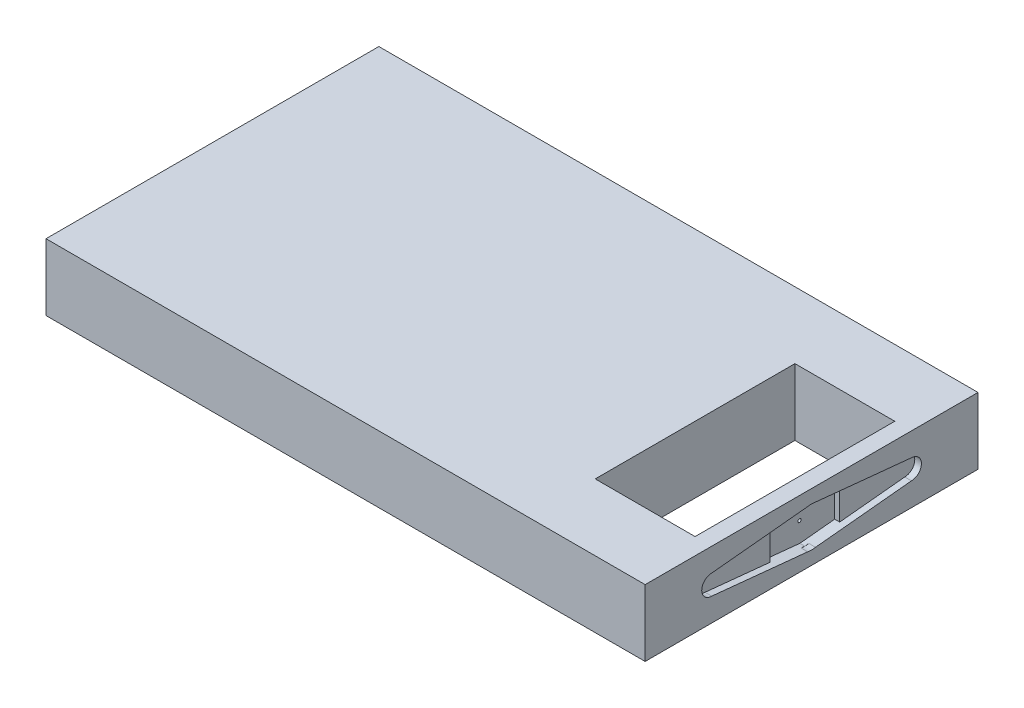
ISO-10303-21;
HEADER;
FILE_DESCRIPTION(('STEP AP214'),'2;1');
FILE_NAME('part.step','',(''),(''),'','','');
FILE_SCHEMA(('AUTOMOTIVE_DESIGN { 1 0 10303 214 1 1 1 1 }'));
ENDSEC;
DATA;
#1=APPLICATION_CONTEXT('core data for automotive mechanical design processes');
#2=APPLICATION_PROTOCOL_DEFINITION('international standard','automotive_design',2000,#1);
#3=PRODUCT_CONTEXT('',#1,'mechanical');
#4=PRODUCT('Part','Part','',(#3));
#5=PRODUCT_RELATED_PRODUCT_CATEGORY('part','',(#4));
#6=PRODUCT_DEFINITION_FORMATION('','',#4);
#7=PRODUCT_DEFINITION_CONTEXT('part definition',#1,'design');
#8=PRODUCT_DEFINITION('design','',#6,#7);
#9=PRODUCT_DEFINITION_SHAPE('','',#8);
#10=(LENGTH_UNIT() NAMED_UNIT(*) SI_UNIT(.MILLI.,.METRE.));
#11=(NAMED_UNIT(*) PLANE_ANGLE_UNIT() SI_UNIT($,.RADIAN.));
#12=(NAMED_UNIT(*) SI_UNIT($,.STERADIAN.) SOLID_ANGLE_UNIT());
#13=UNCERTAINTY_MEASURE_WITH_UNIT(LENGTH_MEASURE(1.E-05),#10,'distance_accuracy_value','');
#14=(GEOMETRIC_REPRESENTATION_CONTEXT(3) GLOBAL_UNCERTAINTY_ASSIGNED_CONTEXT((#13)) GLOBAL_UNIT_ASSIGNED_CONTEXT((#10,
#11,#12)) REPRESENTATION_CONTEXT('',''));
#15=CARTESIAN_POINT('',(0.,0.,0.));
#16=DIRECTION('',(0.,0.,1.));
#17=DIRECTION('',(1.,0.,0.));
#18=AXIS2_PLACEMENT_3D('',#15,#16,#17);
#19=CARTESIAN_POINT('',(178.,0.,0.));
#20=DIRECTION('',(1.,0.,0.));
#21=DIRECTION('',(0.,0.,-1.));
#22=AXIS2_PLACEMENT_3D('',#19,#20,#21);
#23=PLANE('',#22);
#24=DIRECTION('',(0.,1.,0.));
#25=VECTOR('',#24,1.);
#26=CARTESIAN_POINT('',(178.,-1.69293094919177E-13,-60.4478904972049));
#27=LINE('',#26,#25);
#28=CARTESIAN_POINT('',(178.,5.04478904972049,-60.4478904972049));
#29=VERTEX_POINT('',#28);
#30=CARTESIAN_POINT('',(178.,14.9552109502795,-60.4478904972049));
#31=VERTEX_POINT('',#30);
#32=EDGE_CURVE('E372',#29,#31,#27,.T.);
#33=ORIENTED_EDGE('',*,*,#32,.F.);
#34=DIRECTION('',(0.,-0.099503719020999,0.995037190209989));
#35=VECTOR('',#34,1.);
#36=CARTESIAN_POINT('',(178.,-0.990099009900993,-0.0990099009900993));
#37=LINE('',#36,#35);
#38=CARTESIAN_POINT('',(178.,7.,-80.));
#39=VERTEX_POINT('',#38);
#40=EDGE_CURVE('E289',#39,#29,#37,.T.);
#41=ORIENTED_EDGE('',*,*,#40,.F.);
#42=CARTESIAN_POINT('',(178.,10.,-80.));
#43=DIRECTION('',(1.,0.,0.));
#44=DIRECTION('',(0.,0.,-1.));
#45=AXIS2_PLACEMENT_3D('',#42,#43,#44);
#46=CIRCLE('',#45,3.);
#47=CARTESIAN_POINT('',(178.,13.,-80.));
#48=VERTEX_POINT('',#47);
#49=EDGE_CURVE('E292',#39,#48,#46,.T.);
#50=ORIENTED_EDGE('',*,*,#49,.T.);
#51=DIRECTION('',(0.,-0.0995037190209992,-0.995037190209989));
#52=VECTOR('',#51,1.);
#53=CARTESIAN_POINT('',(178.,20.7920792079208,-2.07920792079209));
#54=LINE('',#53,#52);
#55=EDGE_CURVE('E296',#31,#48,#54,.T.);
#56=ORIENTED_EDGE('',*,*,#55,.F.);
#57=EDGE_LOOP('',(#33,#41,#50,#56));
#58=FACE_BOUND('',#57,.T.);
#59=ADVANCED_FACE('F68',(#58),#23,.T.);
#60=DIRECTION('',(0.,0.0995037190209992,-0.995037190209989));
#61=VECTOR('',#60,1.);
#62=CARTESIAN_POINT('',(178.,-0.990099009901004,-0.0990099009901006));
#63=LINE('',#62,#61);
#64=CARTESIAN_POINT('',(178.,4.,-50.));
#65=VERTEX_POINT('',#64);
#66=CARTESIAN_POINT('',(178.,4.11881188118812,-51.1881188118812));
#67=VERTEX_POINT('',#66);
#68=EDGE_CURVE('E280',#65,#67,#63,.T.);
#69=ORIENTED_EDGE('',*,*,#68,.F.);
#70=CARTESIAN_POINT('',(178.,10.,-50.));
#71=DIRECTION('',(1.,0.,0.));
#72=DIRECTION('',(0.,0.,-1.));
#73=AXIS2_PLACEMENT_3D('',#70,#71,#72);
#74=CIRCLE('',#73,6.);
#75=EDGE_CURVE('E343',#65,#67,#74,.T.);
#76=ORIENTED_EDGE('',*,*,#75,.T.);
#77=EDGE_LOOP('',(#69,#76));
#78=FACE_BOUND('',#77,.T.);
#79=ADVANCED_FACE('F475',(#78),#23,.T.);
#80=DIRECTION('',(0.,-0.0995037190209987,-0.995037190209989));
#81=VECTOR('',#80,1.);
#82=CARTESIAN_POINT('',(178.,8.9108910891089,-0.891089108910888));
#83=LINE('',#82,#81);
#84=CARTESIAN_POINT('',(178.,4.11881188118812,-48.8118811881188));
#85=VERTEX_POINT('',#84);
#86=EDGE_CURVE('E266',#85,#65,#83,.T.);
#87=ORIENTED_EDGE('',*,*,#86,.F.);
#88=EDGE_CURVE('E328',#85,#65,#74,.T.);
#89=ORIENTED_EDGE('',*,*,#88,.T.);
#90=EDGE_LOOP('',(#87,#89));
#91=FACE_BOUND('',#90,.T.);
#92=ADVANCED_FACE('F473',(#91),#23,.T.);
#93=DIRECTION('',(0.,-1.,0.));
#94=VECTOR('',#93,1.);
#95=CARTESIAN_POINT('',(178.,-1.38464282484349E-13,-39.5521095027951));
#96=LINE('',#95,#94);
#97=CARTESIAN_POINT('',(178.,14.9552109502795,-39.5521095027951));
#98=VERTEX_POINT('',#97);
#99=CARTESIAN_POINT('',(178.,5.04478904972049,-39.5521095027951));
#100=VERTEX_POINT('',#99);
#101=EDGE_CURVE('E286',#98,#100,#96,.T.);
#102=ORIENTED_EDGE('',*,*,#101,.F.);
#103=DIRECTION('',(0.,0.0995037190209991,-0.995037190209989));
#104=VECTOR('',#103,1.);
#105=CARTESIAN_POINT('',(178.,10.8910891089109,1.08910891089109));
#106=LINE('',#105,#104);
#107=CARTESIAN_POINT('',(178.,13.,-20.));
#108=VERTEX_POINT('',#107);
#109=EDGE_CURVE('E316',#108,#98,#106,.T.);
#110=ORIENTED_EDGE('',*,*,#109,.F.);
#111=CARTESIAN_POINT('',(178.,10.,-20.));
#112=DIRECTION('',(1.,0.,0.));
#113=DIRECTION('',(0.,0.,-1.));
#114=AXIS2_PLACEMENT_3D('',#111,#112,#113);
#115=CIRCLE('',#114,3.);
#116=CARTESIAN_POINT('',(178.,7.,-20.));
#117=VERTEX_POINT('',#116);
#118=EDGE_CURVE('E319',#117,#108,#115,.F.);
#119=ORIENTED_EDGE('',*,*,#118,.F.);
#120=DIRECTION('',(0.,0.099503719020999,0.995037190209989));
#121=VECTOR('',#120,1.);
#122=CARTESIAN_POINT('',(178.,8.91089108910891,-0.891089108910892));
#123=LINE('',#122,#121);
#124=EDGE_CURVE('E322',#100,#117,#123,.T.);
#125=ORIENTED_EDGE('',*,*,#124,.F.);
#126=EDGE_LOOP('',(#102,#110,#119,#125));
#127=FACE_BOUND('',#126,.T.);
#128=ADVANCED_FACE('F466',(#127),#23,.T.);
#129=DIRECTION('',(0.,0.0995037190209989,0.995037190209989));
#130=VECTOR('',#129,1.);
#131=CARTESIAN_POINT('',(178.,20.7920792079208,-2.07920792079208));
#132=LINE('',#131,#130);
#133=CARTESIAN_POINT('',(178.,15.8811881188119,-51.1881188118812));
#134=VERTEX_POINT('',#133);
#135=CARTESIAN_POINT('',(178.,16.,-50.));
#136=VERTEX_POINT('',#135);
#137=EDGE_CURVE('E284',#134,#136,#132,.T.);
#138=ORIENTED_EDGE('',*,*,#137,.F.);
#139=EDGE_CURVE('E345',#134,#136,#74,.T.);
#140=ORIENTED_EDGE('',*,*,#139,.T.);
#141=EDGE_LOOP('',(#138,#140));
#142=FACE_BOUND('',#141,.T.);
#143=ADVANCED_FACE('F481',(#142),#23,.T.);
#144=CARTESIAN_POINT('',(180.,20.,0.));
#145=DIRECTION('',(-1.,0.,0.));
#146=DIRECTION('',(0.,0.,1.));
#147=AXIS2_PLACEMENT_3D('',#144,#145,#146);
#148=PLANE('',#147);
#149=DIRECTION('',(0.,0.,-1.));
#150=VECTOR('',#149,1.);
#151=CARTESIAN_POINT('',(180.,0.,0.));
#152=LINE('',#151,#150);
#153=CARTESIAN_POINT('',(180.,0.,0.));
#154=VERTEX_POINT('',#153);
#155=CARTESIAN_POINT('',(180.,0.,-100.));
#156=VERTEX_POINT('',#155);
#157=EDGE_CURVE('E366',#154,#156,#152,.T.);
#158=ORIENTED_EDGE('',*,*,#157,.T.);
#159=DIRECTION('',(0.,-1.,0.));
#160=VECTOR('',#159,1.);
#161=CARTESIAN_POINT('',(180.,20.,-100.));
#162=LINE('',#161,#160);
#163=CARTESIAN_POINT('',(180.,20.,-100.));
#164=VERTEX_POINT('',#163);
#165=EDGE_CURVE('E376',#164,#156,#162,.T.);
#166=ORIENTED_EDGE('',*,*,#165,.F.);
#167=DIRECTION('',(0.,0.,-1.));
#168=VECTOR('',#167,1.);
#169=CARTESIAN_POINT('',(180.,20.,0.));
#170=LINE('',#169,#168);
#171=CARTESIAN_POINT('',(180.,20.,0.));
#172=VERTEX_POINT('',#171);
#173=EDGE_CURVE('E356',#172,#164,#170,.T.);
#174=ORIENTED_EDGE('',*,*,#173,.F.);
#175=DIRECTION('',(0.,-1.,0.));
#176=VECTOR('',#175,1.);
#177=CARTESIAN_POINT('',(180.,20.,0.));
#178=LINE('',#177,#176);
#179=EDGE_CURVE('E373',#172,#154,#178,.T.);
#180=ORIENTED_EDGE('',*,*,#179,.T.);
#181=EDGE_LOOP('',(#158,#166,#174,#180));
#182=FACE_BOUND('',#181,.T.);
#183=DIRECTION('',(0.,0.0995037190209991,-0.995037190209989));
#184=VECTOR('',#183,1.);
#185=CARTESIAN_POINT('',(180.,10.8910891089109,1.08910891089109));
#186=LINE('',#185,#184);
#187=CARTESIAN_POINT('',(180.,13.,-20.));
#188=VERTEX_POINT('',#187);
#189=CARTESIAN_POINT('',(180.,15.8811881188119,-48.8118811881188));
#190=VERTEX_POINT('',#189);
#191=EDGE_CURVE('E325',#188,#190,#186,.T.);
#192=ORIENTED_EDGE('',*,*,#191,.T.);
#193=CARTESIAN_POINT('',(180.,10.,-50.));
#194=DIRECTION('',(1.,0.,0.));
#195=DIRECTION('',(0.,0.,-1.));
#196=AXIS2_PLACEMENT_3D('',#193,#194,#195);
#197=CIRCLE('',#196,6.);
#198=CARTESIAN_POINT('',(180.,15.8811881188119,-51.1881188118812));
#199=VERTEX_POINT('',#198);
#200=EDGE_CURVE('E288',#199,#190,#197,.T.);
#201=ORIENTED_EDGE('',*,*,#200,.F.);
#202=DIRECTION('',(0.,-0.0995037190209992,-0.995037190209989));
#203=VECTOR('',#202,1.);
#204=CARTESIAN_POINT('',(180.,20.7920792079208,-2.07920792079209));
#205=LINE('',#204,#203);
#206=CARTESIAN_POINT('',(180.,13.,-80.));
#207=VERTEX_POINT('',#206);
#208=EDGE_CURVE('E293',#199,#207,#205,.T.);
#209=ORIENTED_EDGE('',*,*,#208,.T.);
#210=CARTESIAN_POINT('',(180.,10.,-80.));
#211=DIRECTION('',(1.,0.,0.));
#212=DIRECTION('',(0.,0.,-1.));
#213=AXIS2_PLACEMENT_3D('',#210,#211,#212);
#214=CIRCLE('',#213,3.);
#215=CARTESIAN_POINT('',(180.,7.,-80.));
#216=VERTEX_POINT('',#215);
#217=EDGE_CURVE('E301',#216,#207,#214,.T.);
#218=ORIENTED_EDGE('',*,*,#217,.F.);
#219=DIRECTION('',(0.,-0.099503719020999,0.995037190209989));
#220=VECTOR('',#219,1.);
#221=CARTESIAN_POINT('',(180.,-0.990099009900993,-0.0990099009900993));
#222=LINE('',#221,#220);
#223=CARTESIAN_POINT('',(180.,4.11881188118812,-51.1881188118812));
#224=VERTEX_POINT('',#223);
#225=EDGE_CURVE('E299',#216,#224,#222,.T.);
#226=ORIENTED_EDGE('',*,*,#225,.T.);
#227=CARTESIAN_POINT('',(180.,4.11881188118812,-48.8118811881188));
#228=VERTEX_POINT('',#227);
#229=EDGE_CURVE('E346',#228,#224,#197,.T.);
#230=ORIENTED_EDGE('',*,*,#229,.F.);
#231=DIRECTION('',(0.,0.099503719020999,0.995037190209989));
#232=VECTOR('',#231,1.);
#233=CARTESIAN_POINT('',(180.,8.91089108910891,-0.891089108910892));
#234=LINE('',#233,#232);
#235=CARTESIAN_POINT('',(180.,7.,-20.));
#236=VERTEX_POINT('',#235);
#237=EDGE_CURVE('E320',#228,#236,#234,.T.);
#238=ORIENTED_EDGE('',*,*,#237,.T.);
#239=CARTESIAN_POINT('',(180.,10.,-20.));
#240=DIRECTION('',(1.,0.,0.));
#241=DIRECTION('',(0.,0.,-1.));
#242=AXIS2_PLACEMENT_3D('',#239,#240,#241);
#243=CIRCLE('',#242,3.);
#244=EDGE_CURVE('E327',#236,#188,#243,.F.);
#245=ORIENTED_EDGE('',*,*,#244,.T.);
#246=EDGE_LOOP('',(#192,#201,#209,#218,#226,#230,#238,#245));
#247=FACE_BOUND('',#246,.T.);
#248=ADVANCED_FACE('F444',(#182,#247),#148,.F.);
#249=CARTESIAN_POINT('',(0.,20.,0.));
#250=DIRECTION('',(-1.,0.,0.));
#251=DIRECTION('',(0.,0.,1.));
#252=AXIS2_PLACEMENT_3D('',#249,#250,#251);
#253=PLANE('',#252);
#254=DIRECTION('',(0.,0.,-1.));
#255=VECTOR('',#254,1.);
#256=CARTESIAN_POINT('',(0.,0.,0.));
#257=LINE('',#256,#255);
#258=CARTESIAN_POINT('',(0.,0.,0.));
#259=VERTEX_POINT('',#258);
#260=CARTESIAN_POINT('',(0.,0.,-100.));
#261=VERTEX_POINT('',#260);
#262=EDGE_CURVE('E308',#259,#261,#257,.T.);
#263=ORIENTED_EDGE('',*,*,#262,.F.);
#264=DIRECTION('',(0.,-1.,0.));
#265=VECTOR('',#264,1.);
#266=CARTESIAN_POINT('',(0.,20.,0.));
#267=LINE('',#266,#265);
#268=CARTESIAN_POINT('',(0.,20.,0.));
#269=VERTEX_POINT('',#268);
#270=EDGE_CURVE('E370',#269,#259,#267,.T.);
#271=ORIENTED_EDGE('',*,*,#270,.F.);
#272=DIRECTION('',(0.,0.,-1.));
#273=VECTOR('',#272,1.);
#274=CARTESIAN_POINT('',(0.,20.,0.));
#275=LINE('',#274,#273);
#276=CARTESIAN_POINT('',(0.,20.,-100.));
#277=VERTEX_POINT('',#276);
#278=EDGE_CURVE('E349',#269,#277,#275,.T.);
#279=ORIENTED_EDGE('',*,*,#278,.T.);
#280=DIRECTION('',(0.,-1.,0.));
#281=VECTOR('',#280,1.);
#282=CARTESIAN_POINT('',(0.,20.,-100.));
#283=LINE('',#282,#281);
#284=EDGE_CURVE('E360',#277,#261,#283,.T.);
#285=ORIENTED_EDGE('',*,*,#284,.T.);
#286=EDGE_LOOP('',(#263,#271,#279,#285));
#287=FACE_BOUND('',#286,.T.);
#288=ADVANCED_FACE('F70',(#287),#253,.T.);
#289=CARTESIAN_POINT('',(0.,20.,0.));
#290=DIRECTION('',(0.,0.,-1.));
#291=DIRECTION('',(-1.,0.,0.));
#292=AXIS2_PLACEMENT_3D('',#289,#290,#291);
#293=PLANE('',#292);
#294=DIRECTION('',(1.,0.,0.));
#295=VECTOR('',#294,1.);
#296=CARTESIAN_POINT('',(0.,0.,0.));
#297=LINE('',#296,#295);
#298=EDGE_CURVE('E353',#259,#154,#297,.T.);
#299=ORIENTED_EDGE('',*,*,#298,.T.);
#300=ORIENTED_EDGE('',*,*,#179,.F.);
#301=DIRECTION('',(1.,0.,0.));
#302=VECTOR('',#301,1.);
#303=CARTESIAN_POINT('',(0.,20.,0.));
#304=LINE('',#303,#302);
#305=EDGE_CURVE('E358',#269,#172,#304,.T.);
#306=ORIENTED_EDGE('',*,*,#305,.F.);
#307=ORIENTED_EDGE('',*,*,#270,.T.);
#308=EDGE_LOOP('',(#299,#300,#306,#307));
#309=FACE_BOUND('',#308,.T.);
#310=ADVANCED_FACE('F670',(#309),#293,.F.);
#311=CARTESIAN_POINT('',(0.,20.,-100.));
#312=DIRECTION('',(0.,0.,-1.));
#313=DIRECTION('',(-1.,0.,0.));
#314=AXIS2_PLACEMENT_3D('',#311,#312,#313);
#315=PLANE('',#314);
#316=DIRECTION('',(1.,0.,0.));
#317=VECTOR('',#316,1.);
#318=CARTESIAN_POINT('',(0.,0.,-100.));
#319=LINE('',#318,#317);
#320=EDGE_CURVE('E363',#261,#156,#319,.T.);
#321=ORIENTED_EDGE('',*,*,#320,.F.);
#322=ORIENTED_EDGE('',*,*,#284,.F.);
#323=DIRECTION('',(1.,0.,0.));
#324=VECTOR('',#323,1.);
#325=CARTESIAN_POINT('',(0.,20.,-100.));
#326=LINE('',#325,#324);
#327=EDGE_CURVE('E352',#277,#164,#326,.T.);
#328=ORIENTED_EDGE('',*,*,#327,.T.);
#329=ORIENTED_EDGE('',*,*,#165,.T.);
#330=EDGE_LOOP('',(#321,#322,#328,#329));
#331=FACE_BOUND('',#330,.T.);
#332=ADVANCED_FACE('F553',(#331),#315,.T.);
#333=CARTESIAN_POINT('',(0.,20.,0.));
#334=DIRECTION('',(0.,-1.,0.));
#335=DIRECTION('',(0.,0.,-1.));
#336=AXIS2_PLACEMENT_3D('',#333,#334,#335);
#337=PLANE('',#336);
#338=DIRECTION('',(1.,0.,0.));
#339=VECTOR('',#338,1.);
#340=CARTESIAN_POINT('',(145.,20.,-20.));
#341=LINE('',#340,#339);
#342=CARTESIAN_POINT('',(145.,20.,-20.));
#343=VERTEX_POINT('',#342);
#344=CARTESIAN_POINT('',(175.,20.,-20.));
#345=VERTEX_POINT('',#344);
#346=EDGE_CURVE('E228',#343,#345,#341,.T.);
#347=ORIENTED_EDGE('',*,*,#346,.F.);
#348=DIRECTION('',(0.,0.,1.));
#349=VECTOR('',#348,1.);
#350=CARTESIAN_POINT('',(145.,20.,-80.));
#351=LINE('',#350,#349);
#352=CARTESIAN_POINT('',(145.,20.,-80.));
#353=VERTEX_POINT('',#352);
#354=EDGE_CURVE('E83',#353,#343,#351,.T.);
#355=ORIENTED_EDGE('',*,*,#354,.F.);
#356=DIRECTION('',(-1.,0.,0.));
#357=VECTOR('',#356,1.);
#358=CARTESIAN_POINT('',(145.,20.,-80.));
#359=LINE('',#358,#357);
#360=CARTESIAN_POINT('',(175.,20.,-80.));
#361=VERTEX_POINT('',#360);
#362=EDGE_CURVE('E235',#361,#353,#359,.T.);
#363=ORIENTED_EDGE('',*,*,#362,.F.);
#364=DIRECTION('',(0.,0.,-1.));
#365=VECTOR('',#364,1.);
#366=CARTESIAN_POINT('',(175.,20.,-80.));
#367=LINE('',#366,#365);
#368=EDGE_CURVE('E219',#345,#361,#367,.T.);
#369=ORIENTED_EDGE('',*,*,#368,.F.);
#370=EDGE_LOOP('',(#347,#355,#363,#369));
#371=FACE_BOUND('',#370,.T.);
#372=ORIENTED_EDGE('',*,*,#278,.F.);
#373=ORIENTED_EDGE('',*,*,#305,.T.);
#374=ORIENTED_EDGE('',*,*,#173,.T.);
#375=ORIENTED_EDGE('',*,*,#327,.F.);
#376=EDGE_LOOP('',(#372,#373,#374,#375));
#377=FACE_BOUND('',#376,.T.);
#378=ADVANCED_FACE('F232',(#371,#377),#337,.F.);
#379=CARTESIAN_POINT('',(0.,0.,0.));
#380=DIRECTION('',(0.,-1.,0.));
#381=DIRECTION('',(0.,0.,-1.));
#382=AXIS2_PLACEMENT_3D('',#379,#380,#381);
#383=PLANE('',#382);
#384=DIRECTION('',(0.,0.,-1.));
#385=VECTOR('',#384,1.);
#386=CARTESIAN_POINT('',(145.,0.,0.));
#387=LINE('',#386,#385);
#388=CARTESIAN_POINT('',(145.,0.,-20.));
#389=VERTEX_POINT('',#388);
#390=CARTESIAN_POINT('',(145.,0.,-80.));
#391=VERTEX_POINT('',#390);
#392=EDGE_CURVE('E12',#389,#391,#387,.T.);
#393=ORIENTED_EDGE('',*,*,#392,.F.);
#394=DIRECTION('',(-1.,0.,0.));
#395=VECTOR('',#394,1.);
#396=CARTESIAN_POINT('',(0.,0.,-20.));
#397=LINE('',#396,#395);
#398=CARTESIAN_POINT('',(175.,0.,-20.));
#399=VERTEX_POINT('',#398);
#400=EDGE_CURVE('E380',#399,#389,#397,.T.);
#401=ORIENTED_EDGE('',*,*,#400,.F.);
#402=DIRECTION('',(0.,0.,1.));
#403=VECTOR('',#402,1.);
#404=CARTESIAN_POINT('',(175.,0.,0.));
#405=LINE('',#404,#403);
#406=CARTESIAN_POINT('',(175.,0.,-80.));
#407=VERTEX_POINT('',#406);
#408=EDGE_CURVE('E222',#407,#399,#405,.T.);
#409=ORIENTED_EDGE('',*,*,#408,.F.);
#410=DIRECTION('',(1.,0.,0.));
#411=VECTOR('',#410,1.);
#412=CARTESIAN_POINT('',(0.,0.,-80.));
#413=LINE('',#412,#411);
#414=EDGE_CURVE('E76',#391,#407,#413,.T.);
#415=ORIENTED_EDGE('',*,*,#414,.F.);
#416=EDGE_LOOP('',(#393,#401,#409,#415));
#417=FACE_BOUND('',#416,.T.);
#418=ORIENTED_EDGE('',*,*,#262,.T.);
#419=ORIENTED_EDGE('',*,*,#320,.T.);
#420=ORIENTED_EDGE('',*,*,#157,.F.);
#421=ORIENTED_EDGE('',*,*,#298,.F.);
#422=EDGE_LOOP('',(#418,#419,#420,#421));
#423=FACE_BOUND('',#422,.T.);
#424=ADVANCED_FACE('F388',(#417,#423),#383,.T.);
#425=CARTESIAN_POINT('',(178.,20.7920792079208,-2.07920792079209));
#426=DIRECTION('',(0.,-0.995037190209989,0.0995037190209992));
#427=DIRECTION('',(0.,-0.0995037190209992,-0.995037190209989));
#428=AXIS2_PLACEMENT_3D('',#425,#426,#427);
#429=PLANE('',#428);
#430=DIRECTION('',(1.,0.,0.));
#431=VECTOR('',#430,1.);
#432=CARTESIAN_POINT('',(178.,13.,-80.));
#433=LINE('',#432,#431);
#434=EDGE_CURVE('E309',#48,#207,#433,.T.);
#435=ORIENTED_EDGE('',*,*,#434,.T.);
#436=ORIENTED_EDGE('',*,*,#208,.F.);
#437=DIRECTION('',(1.,0.,0.));
#438=VECTOR('',#437,1.);
#439=CARTESIAN_POINT('',(178.,15.8811881188119,-51.1881188118812));
#440=LINE('',#439,#438);
#441=EDGE_CURVE('E306',#134,#199,#440,.T.);
#442=ORIENTED_EDGE('',*,*,#441,.F.);
#443=ORIENTED_EDGE('',*,*,#137,.T.);
#444=DIRECTION('',(1.,0.,0.));
#445=VECTOR('',#444,1.);
#446=CARTESIAN_POINT('',(176.5,16.,-50.));
#447=LINE('',#446,#445);
#448=CARTESIAN_POINT('',(176.5,16.,-50.));
#449=VERTEX_POINT('',#448);
#450=EDGE_CURVE('E262',#449,#136,#447,.T.);
#451=ORIENTED_EDGE('',*,*,#450,.F.);
#452=DIRECTION('',(0.,0.0995037190209989,0.995037190209989));
#453=VECTOR('',#452,1.);
#454=CARTESIAN_POINT('',(176.5,14.9552109502795,-60.4478904972049));
#455=LINE('',#454,#453);
#456=CARTESIAN_POINT('',(176.5,14.9552109502795,-60.4478904972049));
#457=VERTEX_POINT('',#456);
#458=EDGE_CURVE('E242',#457,#449,#455,.T.);
#459=ORIENTED_EDGE('',*,*,#458,.F.);
#460=DIRECTION('',(1.,0.,0.));
#461=VECTOR('',#460,1.);
#462=CARTESIAN_POINT('',(176.5,14.9552109502795,-60.4478904972049));
#463=LINE('',#462,#461);
#464=EDGE_CURVE('E263',#457,#31,#463,.T.);
#465=ORIENTED_EDGE('',*,*,#464,.T.);
#466=ORIENTED_EDGE('',*,*,#55,.T.);
#467=EDGE_LOOP('',(#435,#436,#442,#443,#451,#459,#465,#466));
#468=FACE_BOUND('',#467,.T.);
#469=ADVANCED_FACE('F411',(#468),#429,.T.);
#470=CARTESIAN_POINT('',(178.,10.,-80.));
#471=DIRECTION('',(1.,0.,0.));
#472=DIRECTION('',(0.,0.,-1.));
#473=AXIS2_PLACEMENT_3D('',#470,#471,#472);
#474=CYLINDRICAL_SURFACE('',#473,3.);
#475=ORIENTED_EDGE('',*,*,#217,.T.);
#476=ORIENTED_EDGE('',*,*,#434,.F.);
#477=ORIENTED_EDGE('',*,*,#49,.F.);
#478=DIRECTION('',(1.,0.,0.));
#479=VECTOR('',#478,1.);
#480=CARTESIAN_POINT('',(178.,7.,-80.));
#481=LINE('',#480,#479);
#482=EDGE_CURVE('E312',#39,#216,#481,.T.);
#483=ORIENTED_EDGE('',*,*,#482,.T.);
#484=EDGE_LOOP('',(#475,#476,#477,#483));
#485=FACE_BOUND('',#484,.T.);
#486=ADVANCED_FACE('F440',(#485),#474,.F.);
#487=CARTESIAN_POINT('',(178.,-0.990099009900993,-0.0990099009900993));
#488=DIRECTION('',(0.,0.995037190209989,0.099503719020999));
#489=DIRECTION('',(0.,-0.099503719020999,0.995037190209989));
#490=AXIS2_PLACEMENT_3D('',#487,#488,#489);
#491=PLANE('',#490);
#492=ORIENTED_EDGE('',*,*,#40,.T.);
#493=DIRECTION('',(1.,0.,0.));
#494=VECTOR('',#493,1.);
#495=CARTESIAN_POINT('',(176.5,5.04478904972049,-60.4478904972049));
#496=LINE('',#495,#494);
#497=CARTESIAN_POINT('',(176.5,5.04478904972049,-60.4478904972049));
#498=VERTEX_POINT('',#497);
#499=EDGE_CURVE('E267',#498,#29,#496,.T.);
#500=ORIENTED_EDGE('',*,*,#499,.F.);
#501=DIRECTION('',(0.,0.0995037190209992,-0.995037190209989));
#502=VECTOR('',#501,1.);
#503=CARTESIAN_POINT('',(176.5,4.,-50.));
#504=LINE('',#503,#502);
#505=CARTESIAN_POINT('',(176.5,4.,-50.));
#506=VERTEX_POINT('',#505);
#507=EDGE_CURVE('E256',#506,#498,#504,.T.);
#508=ORIENTED_EDGE('',*,*,#507,.F.);
#509=DIRECTION('',(1.,0.,0.));
#510=VECTOR('',#509,1.);
#511=CARTESIAN_POINT('',(176.5,4.,-50.));
#512=LINE('',#511,#510);
#513=EDGE_CURVE('E269',#506,#65,#512,.T.);
#514=ORIENTED_EDGE('',*,*,#513,.T.);
#515=ORIENTED_EDGE('',*,*,#68,.T.);
#516=DIRECTION('',(1.,0.,0.));
#517=VECTOR('',#516,1.);
#518=CARTESIAN_POINT('',(178.,4.11881188118812,-51.1881188118812));
#519=LINE('',#518,#517);
#520=EDGE_CURVE('E298',#67,#224,#519,.T.);
#521=ORIENTED_EDGE('',*,*,#520,.T.);
#522=ORIENTED_EDGE('',*,*,#225,.F.);
#523=ORIENTED_EDGE('',*,*,#482,.F.);
#524=EDGE_LOOP('',(#492,#500,#508,#514,#515,#521,#522,#523));
#525=FACE_BOUND('',#524,.T.);
#526=ADVANCED_FACE('F430',(#525),#491,.T.);
#527=DIRECTION('',(0.,-0.0995037190209989,0.995037190209989));
#528=VECTOR('',#527,1.);
#529=CARTESIAN_POINT('',(178.,10.8910891089109,1.08910891089109));
#530=LINE('',#529,#528);
#531=CARTESIAN_POINT('',(178.,15.8811881188119,-48.8118811881188));
#532=VERTEX_POINT('',#531);
#533=EDGE_CURVE('E282',#136,#532,#530,.T.);
#534=ORIENTED_EDGE('',*,*,#533,.F.);
#535=EDGE_CURVE('E344',#136,#532,#74,.T.);
#536=ORIENTED_EDGE('',*,*,#535,.T.);
#537=EDGE_LOOP('',(#534,#536));
#538=FACE_BOUND('',#537,.T.);
#539=ADVANCED_FACE('F458',(#538),#23,.T.);
#540=CARTESIAN_POINT('',(178.,10.,-20.));
#541=DIRECTION('',(1.,0.,0.));
#542=DIRECTION('',(0.,0.,-1.));
#543=AXIS2_PLACEMENT_3D('',#540,#541,#542);
#544=CYLINDRICAL_SURFACE('',#543,3.);
#545=ORIENTED_EDGE('',*,*,#244,.F.);
#546=DIRECTION('',(1.,0.,0.));
#547=VECTOR('',#546,1.);
#548=CARTESIAN_POINT('',(178.,7.,-20.));
#549=LINE('',#548,#547);
#550=EDGE_CURVE('E334',#117,#236,#549,.T.);
#551=ORIENTED_EDGE('',*,*,#550,.F.);
#552=ORIENTED_EDGE('',*,*,#118,.T.);
#553=DIRECTION('',(1.,0.,0.));
#554=VECTOR('',#553,1.);
#555=CARTESIAN_POINT('',(178.,13.,-20.));
#556=LINE('',#555,#554);
#557=EDGE_CURVE('E337',#108,#188,#556,.T.);
#558=ORIENTED_EDGE('',*,*,#557,.T.);
#559=EDGE_LOOP('',(#545,#551,#552,#558));
#560=FACE_BOUND('',#559,.T.);
#561=ADVANCED_FACE('F463',(#560),#544,.F.);
#562=CARTESIAN_POINT('',(178.,10.8910891089109,1.08910891089109));
#563=DIRECTION('',(0.,-0.995037190209989,-0.0995037190209991));
#564=DIRECTION('',(0.,0.0995037190209991,-0.995037190209989));
#565=AXIS2_PLACEMENT_3D('',#562,#563,#564);
#566=PLANE('',#565);
#567=ORIENTED_EDGE('',*,*,#109,.T.);
#568=DIRECTION('',(1.,0.,0.));
#569=VECTOR('',#568,1.);
#570=CARTESIAN_POINT('',(176.5,14.9552109502795,-39.5521095027951));
#571=LINE('',#570,#569);
#572=CARTESIAN_POINT('',(176.5,14.9552109502795,-39.5521095027951));
#573=VERTEX_POINT('',#572);
#574=EDGE_CURVE('E275',#573,#98,#571,.T.);
#575=ORIENTED_EDGE('',*,*,#574,.F.);
#576=DIRECTION('',(0.,-0.0995037190209989,0.995037190209989));
#577=VECTOR('',#576,1.);
#578=CARTESIAN_POINT('',(176.5,16.,-50.));
#579=LINE('',#578,#577);
#580=EDGE_CURVE('E247',#449,#573,#579,.T.);
#581=ORIENTED_EDGE('',*,*,#580,.F.);
#582=ORIENTED_EDGE('',*,*,#450,.T.);
#583=ORIENTED_EDGE('',*,*,#533,.T.);
#584=DIRECTION('',(1.,0.,0.));
#585=VECTOR('',#584,1.);
#586=CARTESIAN_POINT('',(178.,15.8811881188119,-48.8118811881188));
#587=LINE('',#586,#585);
#588=EDGE_CURVE('E324',#532,#190,#587,.T.);
#589=ORIENTED_EDGE('',*,*,#588,.T.);
#590=ORIENTED_EDGE('',*,*,#191,.F.);
#591=ORIENTED_EDGE('',*,*,#557,.F.);
#592=EDGE_LOOP('',(#567,#575,#581,#582,#583,#589,#590,#591));
#593=FACE_BOUND('',#592,.T.);
#594=ADVANCED_FACE('F416',(#593),#566,.T.);
#595=CARTESIAN_POINT('',(178.,8.91089108910891,-0.891089108910892));
#596=DIRECTION('',(0.,0.995037190209989,-0.099503719020999));
#597=DIRECTION('',(0.,0.099503719020999,0.995037190209989));
#598=AXIS2_PLACEMENT_3D('',#595,#596,#597);
#599=PLANE('',#598);
#600=ORIENTED_EDGE('',*,*,#550,.T.);
#601=ORIENTED_EDGE('',*,*,#237,.F.);
#602=DIRECTION('',(1.,0.,0.));
#603=VECTOR('',#602,1.);
#604=CARTESIAN_POINT('',(178.,4.11881188118812,-48.8118811881188));
#605=LINE('',#604,#603);
#606=EDGE_CURVE('E302',#85,#228,#605,.T.);
#607=ORIENTED_EDGE('',*,*,#606,.F.);
#608=ORIENTED_EDGE('',*,*,#86,.T.);
#609=ORIENTED_EDGE('',*,*,#513,.F.);
#610=DIRECTION('',(0.,-0.0995037190209987,-0.995037190209989));
#611=VECTOR('',#610,1.);
#612=CARTESIAN_POINT('',(176.5,5.04478904972049,-39.5521095027951));
#613=LINE('',#612,#611);
#614=CARTESIAN_POINT('',(176.5,5.04478904972049,-39.5521095027951));
#615=VERTEX_POINT('',#614);
#616=EDGE_CURVE('E253',#615,#506,#613,.T.);
#617=ORIENTED_EDGE('',*,*,#616,.F.);
#618=DIRECTION('',(1.,0.,0.));
#619=VECTOR('',#618,1.);
#620=CARTESIAN_POINT('',(176.5,5.04478904972049,-39.5521095027951));
#621=LINE('',#620,#619);
#622=EDGE_CURVE('E272',#615,#100,#621,.T.);
#623=ORIENTED_EDGE('',*,*,#622,.T.);
#624=ORIENTED_EDGE('',*,*,#124,.T.);
#625=EDGE_LOOP('',(#600,#601,#607,#608,#609,#617,#623,#624));
#626=FACE_BOUND('',#625,.T.);
#627=ADVANCED_FACE('F425',(#626),#599,.T.);
#628=CARTESIAN_POINT('',(178.,10.,-50.));
#629=DIRECTION('',(1.,0.,0.));
#630=DIRECTION('',(0.,0.,-1.));
#631=AXIS2_PLACEMENT_3D('',#628,#629,#630);
#632=CYLINDRICAL_SURFACE('',#631,6.);
#633=ORIENTED_EDGE('',*,*,#535,.F.);
#634=ORIENTED_EDGE('',*,*,#139,.F.);
#635=ORIENTED_EDGE('',*,*,#441,.T.);
#636=ORIENTED_EDGE('',*,*,#200,.T.);
#637=ORIENTED_EDGE('',*,*,#588,.F.);
#638=EDGE_LOOP('',(#633,#634,#635,#636,#637));
#639=FACE_BOUND('',#638,.T.);
#640=ADVANCED_FACE('F452',(#639),#632,.F.);
#641=ORIENTED_EDGE('',*,*,#229,.T.);
#642=ORIENTED_EDGE('',*,*,#520,.F.);
#643=ORIENTED_EDGE('',*,*,#75,.F.);
#644=ORIENTED_EDGE('',*,*,#88,.F.);
#645=ORIENTED_EDGE('',*,*,#606,.T.);
#646=EDGE_LOOP('',(#641,#642,#643,#644,#645));
#647=FACE_BOUND('',#646,.T.);
#648=ADVANCED_FACE('F469',(#647),#632,.F.);
#649=CARTESIAN_POINT('',(176.5,5.04478904972049,-60.4478904972049));
#650=DIRECTION('',(0.,0.,-1.));
#651=DIRECTION('',(0.,1.,0.));
#652=AXIS2_PLACEMENT_3D('',#649,#650,#651);
#653=PLANE('',#652);
#654=ORIENTED_EDGE('',*,*,#32,.T.);
#655=ORIENTED_EDGE('',*,*,#464,.F.);
#656=DIRECTION('',(0.,1.,0.));
#657=VECTOR('',#656,1.);
#658=CARTESIAN_POINT('',(176.5,5.04478904972049,-60.4478904972049));
#659=LINE('',#658,#657);
#660=EDGE_CURVE('E259',#498,#457,#659,.T.);
#661=ORIENTED_EDGE('',*,*,#660,.F.);
#662=ORIENTED_EDGE('',*,*,#499,.T.);
#663=EDGE_LOOP('',(#654,#655,#661,#662));
#664=FACE_BOUND('',#663,.T.);
#665=ADVANCED_FACE('F434',(#664),#653,.F.);
#666=CARTESIAN_POINT('',(176.5,14.9552109502795,-39.5521095027951));
#667=DIRECTION('',(0.,0.,1.));
#668=DIRECTION('',(0.,-1.,0.));
#669=AXIS2_PLACEMENT_3D('',#666,#667,#668);
#670=PLANE('',#669);
#671=ORIENTED_EDGE('',*,*,#101,.T.);
#672=ORIENTED_EDGE('',*,*,#622,.F.);
#673=DIRECTION('',(0.,-1.,0.));
#674=VECTOR('',#673,1.);
#675=CARTESIAN_POINT('',(176.5,14.9552109502795,-39.5521095027951));
#676=LINE('',#675,#674);
#677=EDGE_CURVE('E250',#573,#615,#676,.T.);
#678=ORIENTED_EDGE('',*,*,#677,.F.);
#679=ORIENTED_EDGE('',*,*,#574,.T.);
#680=EDGE_LOOP('',(#671,#672,#678,#679));
#681=FACE_BOUND('',#680,.T.);
#682=ADVANCED_FACE('F405',(#681),#670,.F.);
#683=CARTESIAN_POINT('',(176.5,0.,0.));
#684=DIRECTION('',(1.,0.,0.));
#685=DIRECTION('',(0.,0.,-1.));
#686=AXIS2_PLACEMENT_3D('',#683,#684,#685);
#687=PLANE('',#686);
#688=CARTESIAN_POINT('',(176.5,9.95251224565937,-49.8773495687171));
#689=DIRECTION('',(1.,0.,0.));
#690=DIRECTION('',(0.,0.,-1.));
#691=AXIS2_PLACEMENT_3D('',#688,#689,#690);
#692=CIRCLE('',#691,0.499999999999999);
#693=CARTESIAN_POINT('',(176.5,9.95251224565937,-50.3773495687171));
#694=VERTEX_POINT('',#693);
#695=EDGE_CURVE('E393',#694,#694,#692,.T.);
#696=ORIENTED_EDGE('',*,*,#695,.F.);
#697=EDGE_LOOP('',(#696));
#698=FACE_BOUND('',#697,.T.);
#699=ORIENTED_EDGE('',*,*,#458,.T.);
#700=ORIENTED_EDGE('',*,*,#580,.T.);
#701=ORIENTED_EDGE('',*,*,#677,.T.);
#702=ORIENTED_EDGE('',*,*,#616,.T.);
#703=ORIENTED_EDGE('',*,*,#507,.T.);
#704=ORIENTED_EDGE('',*,*,#660,.T.);
#705=EDGE_LOOP('',(#699,#700,#701,#702,#703,#704));
#706=FACE_BOUND('',#705,.T.);
#707=ADVANCED_FACE('F402',(#698,#706),#687,.T.);
#708=CARTESIAN_POINT('',(145.,-30.,-80.));
#709=DIRECTION('',(-1.,0.,0.));
#710=DIRECTION('',(0.,0.,1.));
#711=AXIS2_PLACEMENT_3D('',#708,#709,#710);
#712=PLANE('',#711);
#713=ORIENTED_EDGE('',*,*,#392,.T.);
#714=DIRECTION('',(0.,1.,0.));
#715=VECTOR('',#714,1.);
#716=CARTESIAN_POINT('',(145.,-30.,-80.));
#717=LINE('',#716,#715);
#718=EDGE_CURVE('E240',#391,#353,#717,.T.);
#719=ORIENTED_EDGE('',*,*,#718,.T.);
#720=ORIENTED_EDGE('',*,*,#354,.T.);
#721=DIRECTION('',(0.,1.,0.));
#722=VECTOR('',#721,1.);
#723=CARTESIAN_POINT('',(145.,-30.,-20.));
#724=LINE('',#723,#722);
#725=EDGE_CURVE('E225',#389,#343,#724,.T.);
#726=ORIENTED_EDGE('',*,*,#725,.F.);
#727=EDGE_LOOP('',(#713,#719,#720,#726));
#728=FACE_BOUND('',#727,.T.);
#729=ADVANCED_FACE('F390',(#728),#712,.F.);
#730=CARTESIAN_POINT('',(145.,-30.,-80.));
#731=DIRECTION('',(0.,0.,-1.));
#732=DIRECTION('',(-1.,0.,0.));
#733=AXIS2_PLACEMENT_3D('',#730,#731,#732);
#734=PLANE('',#733);
#735=ORIENTED_EDGE('',*,*,#414,.T.);
#736=DIRECTION('',(0.,1.,0.));
#737=VECTOR('',#736,1.);
#738=CARTESIAN_POINT('',(175.,-30.,-80.));
#739=LINE('',#738,#737);
#740=EDGE_CURVE('E224',#407,#361,#739,.T.);
#741=ORIENTED_EDGE('',*,*,#740,.T.);
#742=ORIENTED_EDGE('',*,*,#362,.T.);
#743=ORIENTED_EDGE('',*,*,#718,.F.);
#744=EDGE_LOOP('',(#735,#741,#742,#743));
#745=FACE_BOUND('',#744,.T.);
#746=ADVANCED_FACE('F385',(#745),#734,.F.);
#747=CARTESIAN_POINT('',(175.,-30.,-80.));
#748=DIRECTION('',(1.,0.,0.));
#749=DIRECTION('',(0.,0.,-1.));
#750=AXIS2_PLACEMENT_3D('',#747,#748,#749);
#751=PLANE('',#750);
#752=CARTESIAN_POINT('',(175.,9.95251224565937,-49.8773495687171));
#753=DIRECTION('',(1.,0.,0.));
#754=DIRECTION('',(0.,0.,-1.));
#755=AXIS2_PLACEMENT_3D('',#752,#753,#754);
#756=CIRCLE('',#755,0.499999999999999);
#757=CARTESIAN_POINT('',(175.,9.95251224565937,-50.3773495687171));
#758=VERTEX_POINT('',#757);
#759=EDGE_CURVE('E391',#758,#758,#756,.T.);
#760=ORIENTED_EDGE('',*,*,#759,.T.);
#761=EDGE_LOOP('',(#760));
#762=FACE_BOUND('',#761,.T.);
#763=ORIENTED_EDGE('',*,*,#408,.T.);
#764=DIRECTION('',(0.,1.,0.));
#765=VECTOR('',#764,1.);
#766=CARTESIAN_POINT('',(175.,-30.,-20.));
#767=LINE('',#766,#765);
#768=EDGE_CURVE('E91',#399,#345,#767,.T.);
#769=ORIENTED_EDGE('',*,*,#768,.T.);
#770=ORIENTED_EDGE('',*,*,#368,.T.);
#771=ORIENTED_EDGE('',*,*,#740,.F.);
#772=EDGE_LOOP('',(#763,#769,#770,#771));
#773=FACE_BOUND('',#772,.T.);
#774=ADVANCED_FACE('F216',(#762,#773),#751,.F.);
#775=CARTESIAN_POINT('',(145.,-30.,-20.));
#776=DIRECTION('',(0.,0.,1.));
#777=DIRECTION('',(1.,0.,0.));
#778=AXIS2_PLACEMENT_3D('',#775,#776,#777);
#779=PLANE('',#778);
#780=ORIENTED_EDGE('',*,*,#400,.T.);
#781=ORIENTED_EDGE('',*,*,#725,.T.);
#782=ORIENTED_EDGE('',*,*,#346,.T.);
#783=ORIENTED_EDGE('',*,*,#768,.F.);
#784=EDGE_LOOP('',(#780,#781,#782,#783));
#785=FACE_BOUND('',#784,.T.);
#786=ADVANCED_FACE('F229',(#785),#779,.F.);
#787=CARTESIAN_POINT('',(176.5,9.95251224565937,-49.8773495687171));
#788=DIRECTION('',(1.,0.,0.));
#789=DIRECTION('',(0.,0.,-1.));
#790=AXIS2_PLACEMENT_3D('',#787,#788,#789);
#791=CYLINDRICAL_SURFACE('',#790,0.499999999999999);
#792=ORIENTED_EDGE('',*,*,#695,.T.);
#793=EDGE_LOOP('',(#792));
#794=FACE_BOUND('',#793,.T.);
#795=ORIENTED_EDGE('',*,*,#759,.F.);
#796=EDGE_LOOP('',(#795));
#797=FACE_BOUND('',#796,.T.);
#798=ADVANCED_FACE('F399',(#794,#797),#791,.F.);
#799=CLOSED_SHELL('',(#59,#79,#92,#128,#143,#248,#288,#310,#332,#378,#424,#469,#486,#526,#539,
#561,#594,#627,#640,#648,#665,#682,#707,#729,#746,#774,#786,#798));
#800=MANIFOLD_SOLID_BREP('B2',#799);
#801=ADVANCED_BREP_SHAPE_REPRESENTATION('',(#18,#800),#14);
#802=SHAPE_DEFINITION_REPRESENTATION(#9,#801);
ENDSEC;
END-ISO-10303-21;
